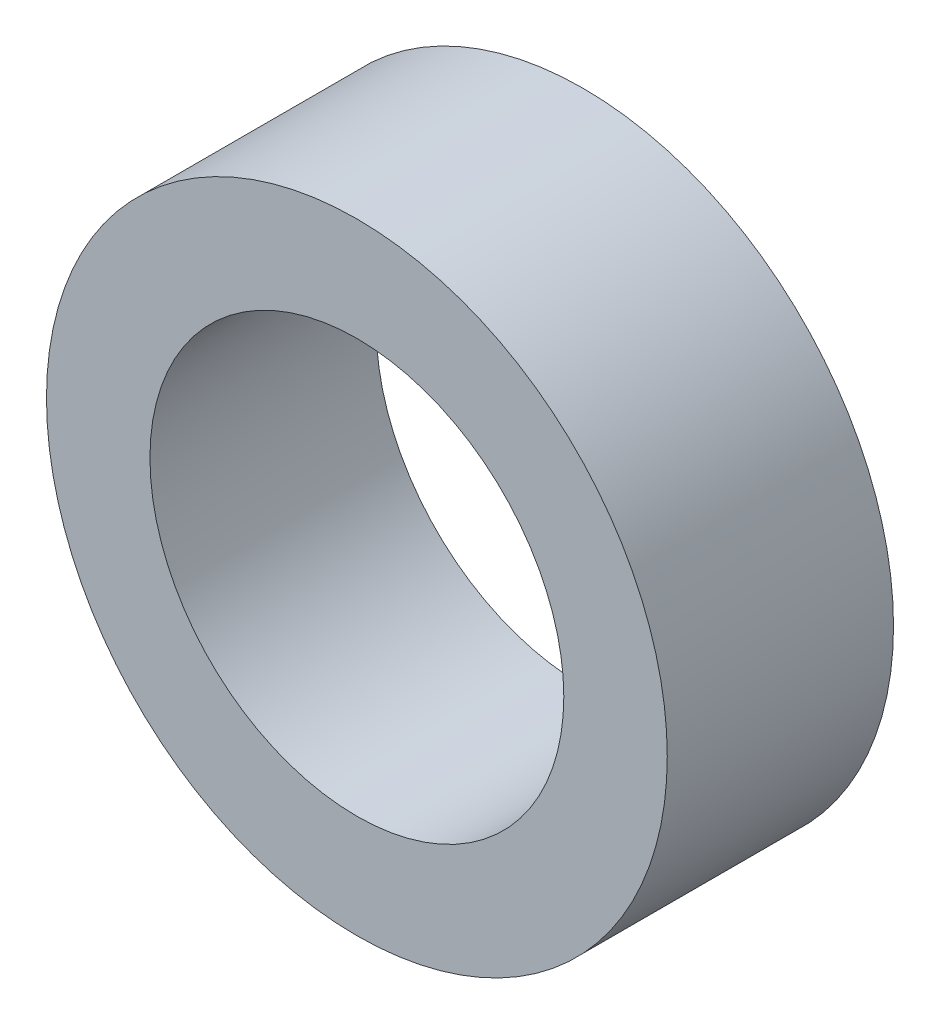
ISO-10303-21;
HEADER;
FILE_DESCRIPTION(('STEP AP214'),'2;1');
FILE_NAME('part.step','',(''),(''),'','','');
FILE_SCHEMA(('AUTOMOTIVE_DESIGN { 1 0 10303 214 1 1 1 1 }'));
ENDSEC;
DATA;
#1=APPLICATION_CONTEXT('core data for automotive mechanical design processes');
#2=APPLICATION_PROTOCOL_DEFINITION('international standard','automotive_design',2000,#1);
#3=PRODUCT_CONTEXT('',#1,'mechanical');
#4=PRODUCT('Part','Part','',(#3));
#5=PRODUCT_RELATED_PRODUCT_CATEGORY('part','',(#4));
#6=PRODUCT_DEFINITION_FORMATION('','',#4);
#7=PRODUCT_DEFINITION_CONTEXT('part definition',#1,'design');
#8=PRODUCT_DEFINITION('design','',#6,#7);
#9=PRODUCT_DEFINITION_SHAPE('','',#8);
#10=(LENGTH_UNIT() NAMED_UNIT(*) SI_UNIT(.MILLI.,.METRE.));
#11=(NAMED_UNIT(*) PLANE_ANGLE_UNIT() SI_UNIT($,.RADIAN.));
#12=(NAMED_UNIT(*) SI_UNIT($,.STERADIAN.) SOLID_ANGLE_UNIT());
#13=UNCERTAINTY_MEASURE_WITH_UNIT(LENGTH_MEASURE(1.E-05),#10,'distance_accuracy_value','');
#14=(GEOMETRIC_REPRESENTATION_CONTEXT(3) GLOBAL_UNCERTAINTY_ASSIGNED_CONTEXT((#13)) GLOBAL_UNIT_ASSIGNED_CONTEXT((#10,
#11,#12)) REPRESENTATION_CONTEXT('',''));
#15=CARTESIAN_POINT('',(0.,0.,0.));
#16=DIRECTION('',(0.,0.,1.));
#17=DIRECTION('',(1.,0.,0.));
#18=AXIS2_PLACEMENT_3D('',#15,#16,#17);
#19=CARTESIAN_POINT('',(-17.7,-16.75,1.64));
#20=DIRECTION('',(0.,0.,1.));
#21=DIRECTION('',(1.,0.,0.));
#22=AXIS2_PLACEMENT_3D('',#19,#20,#21);
#23=PLANE('',#22);
#24=CARTESIAN_POINT('',(-2.5,-2.5,1.64));
#25=DIRECTION('',(0.,0.,1.));
#26=DIRECTION('',(1.,0.,0.));
#27=AXIS2_PLACEMENT_3D('',#24,#25,#26);
#28=CIRCLE('',#27,1.5);
#29=CARTESIAN_POINT('',(-1.,-2.5,1.64));
#30=VERTEX_POINT('',#29);
#31=EDGE_CURVE('E20',#30,#30,#28,.T.);
#32=ORIENTED_EDGE('',*,*,#31,.F.);
#33=EDGE_LOOP('',(#32));
#34=FACE_BOUND('',#33,.T.);
#35=CARTESIAN_POINT('',(-2.5,-2.5,1.64));
#36=DIRECTION('',(0.,0.,1.));
#37=DIRECTION('',(1.,0.,0.));
#38=AXIS2_PLACEMENT_3D('',#35,#36,#37);
#39=CIRCLE('',#38,2.25);
#40=CARTESIAN_POINT('',(-0.25,-2.5,1.64));
#41=VERTEX_POINT('',#40);
#42=EDGE_CURVE('E11',#41,#41,#39,.T.);
#43=ORIENTED_EDGE('',*,*,#42,.T.);
#44=EDGE_LOOP('',(#43));
#45=FACE_BOUND('',#44,.T.);
#46=ADVANCED_FACE('F16',(#34,#45),#23,.T.);
#47=CARTESIAN_POINT('',(-17.7,-16.75,0.));
#48=DIRECTION('',(0.,0.,1.));
#49=DIRECTION('',(1.,0.,0.));
#50=AXIS2_PLACEMENT_3D('',#47,#48,#49);
#51=PLANE('',#50);
#52=CARTESIAN_POINT('',(-2.5,-2.5,0.));
#53=DIRECTION('',(0.,0.,1.));
#54=DIRECTION('',(1.,0.,0.));
#55=AXIS2_PLACEMENT_3D('',#52,#53,#54);
#56=CIRCLE('',#55,1.5);
#57=CARTESIAN_POINT('',(-1.,-2.5,0.));
#58=VERTEX_POINT('',#57);
#59=EDGE_CURVE('E46',#58,#58,#56,.T.);
#60=ORIENTED_EDGE('',*,*,#59,.T.);
#61=EDGE_LOOP('',(#60));
#62=FACE_BOUND('',#61,.T.);
#63=CARTESIAN_POINT('',(-2.5,-2.5,0.));
#64=DIRECTION('',(0.,0.,1.));
#65=DIRECTION('',(1.,0.,0.));
#66=AXIS2_PLACEMENT_3D('',#63,#64,#65);
#67=CIRCLE('',#66,2.25);
#68=CARTESIAN_POINT('',(-0.25,-2.5,0.));
#69=VERTEX_POINT('',#68);
#70=EDGE_CURVE('E27',#69,#69,#67,.T.);
#71=ORIENTED_EDGE('',*,*,#70,.F.);
#72=EDGE_LOOP('',(#71));
#73=FACE_BOUND('',#72,.T.);
#74=ADVANCED_FACE('F70',(#62,#73),#51,.F.);
#75=CARTESIAN_POINT('',(-2.5,-2.5,1.64));
#76=DIRECTION('',(0.,0.,1.));
#77=DIRECTION('',(-1.,0.,0.));
#78=AXIS2_PLACEMENT_3D('',#75,#76,#77);
#79=CYLINDRICAL_SURFACE('',#78,2.25);
#80=ORIENTED_EDGE('',*,*,#42,.F.);
#81=EDGE_LOOP('',(#80));
#82=FACE_BOUND('',#81,.T.);
#83=ORIENTED_EDGE('',*,*,#70,.T.);
#84=EDGE_LOOP('',(#83));
#85=FACE_BOUND('',#84,.T.);
#86=ADVANCED_FACE('F68',(#82,#85),#79,.T.);
#87=CARTESIAN_POINT('',(-2.5,-2.5,1.64));
#88=DIRECTION('',(0.,0.,1.));
#89=DIRECTION('',(-1.,0.,0.));
#90=AXIS2_PLACEMENT_3D('',#87,#88,#89);
#91=CYLINDRICAL_SURFACE('',#90,1.5);
#92=ORIENTED_EDGE('',*,*,#31,.T.);
#93=EDGE_LOOP('',(#92));
#94=FACE_BOUND('',#93,.T.);
#95=ORIENTED_EDGE('',*,*,#59,.F.);
#96=EDGE_LOOP('',(#95));
#97=FACE_BOUND('',#96,.T.);
#98=ADVANCED_FACE('F18',(#94,#97),#91,.F.);
#99=CLOSED_SHELL('',(#46,#74,#86,#98));
#100=MANIFOLD_SOLID_BREP('B1',#99);
#101=ADVANCED_BREP_SHAPE_REPRESENTATION('',(#18,#100),#14);
#102=SHAPE_DEFINITION_REPRESENTATION(#9,#101);
ENDSEC;
END-ISO-10303-21;
